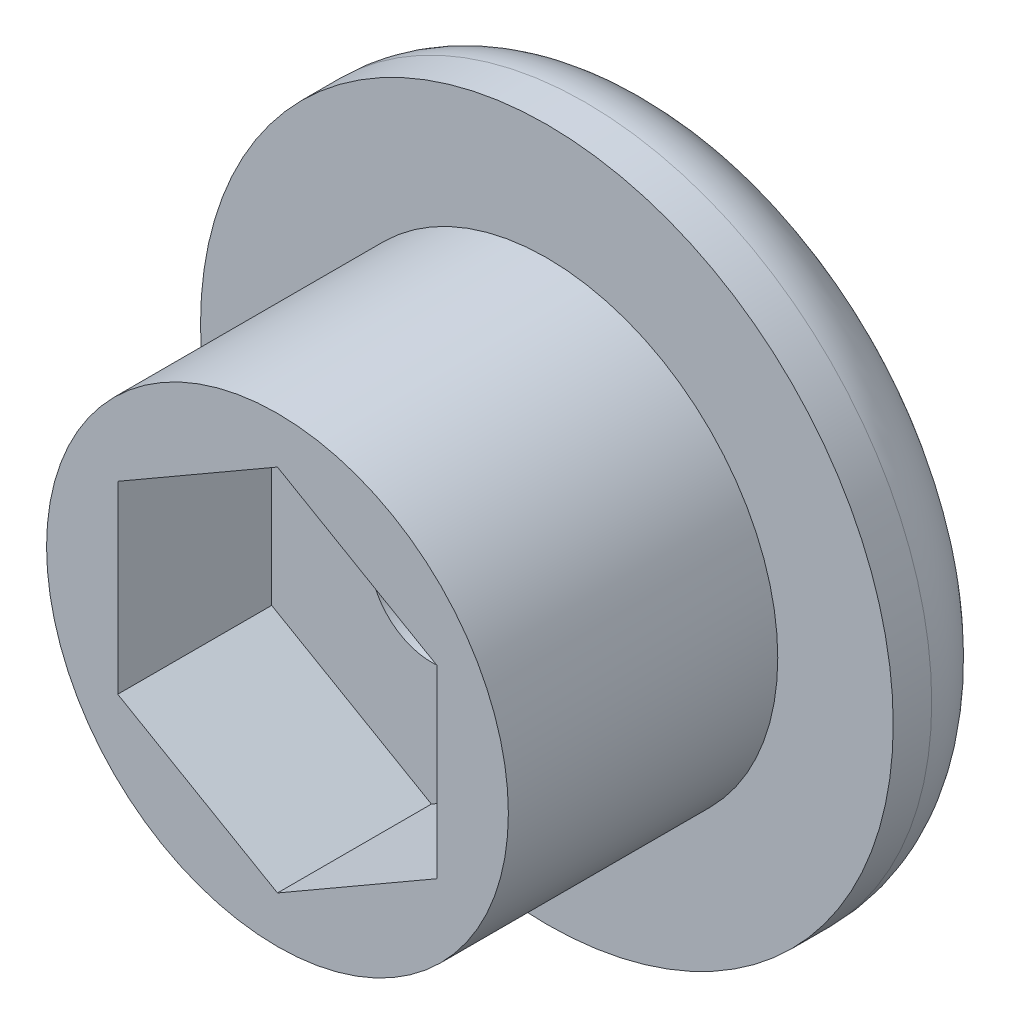
ISO-10303-21;
HEADER;
FILE_DESCRIPTION(('STEP AP214'),'2;1');
FILE_NAME('part.step','',(''),(''),'','','');
FILE_SCHEMA(('AUTOMOTIVE_DESIGN { 1 0 10303 214 1 1 1 1 }'));
ENDSEC;
DATA;
#1=APPLICATION_CONTEXT('core data for automotive mechanical design processes');
#2=APPLICATION_PROTOCOL_DEFINITION('international standard','automotive_design',2000,#1);
#3=PRODUCT_CONTEXT('',#1,'mechanical');
#4=PRODUCT('Part','Part','',(#3));
#5=PRODUCT_RELATED_PRODUCT_CATEGORY('part','',(#4));
#6=PRODUCT_DEFINITION_FORMATION('','',#4);
#7=PRODUCT_DEFINITION_CONTEXT('part definition',#1,'design');
#8=PRODUCT_DEFINITION('design','',#6,#7);
#9=PRODUCT_DEFINITION_SHAPE('','',#8);
#10=(LENGTH_UNIT() NAMED_UNIT(*) SI_UNIT(.MILLI.,.METRE.));
#11=(NAMED_UNIT(*) PLANE_ANGLE_UNIT() SI_UNIT($,.RADIAN.));
#12=(NAMED_UNIT(*) SI_UNIT($,.STERADIAN.) SOLID_ANGLE_UNIT());
#13=UNCERTAINTY_MEASURE_WITH_UNIT(LENGTH_MEASURE(1.E-05),#10,'distance_accuracy_value','');
#14=(GEOMETRIC_REPRESENTATION_CONTEXT(3) GLOBAL_UNCERTAINTY_ASSIGNED_CONTEXT((#13)) GLOBAL_UNIT_ASSIGNED_CONTEXT((#10,
#11,#12)) REPRESENTATION_CONTEXT('',''));
#15=CARTESIAN_POINT('',(0.,0.,0.));
#16=DIRECTION('',(0.,0.,1.));
#17=DIRECTION('',(1.,0.,0.));
#18=AXIS2_PLACEMENT_3D('',#15,#16,#17);
#19=CARTESIAN_POINT('',(-13.5093210312387,-3.65723132460791,43.05));
#20=DIRECTION('',(0.,0.,-1.));
#21=DIRECTION('',(0.,1.,0.));
#22=AXIS2_PLACEMENT_3D('',#19,#20,#21);
#23=CYLINDRICAL_SURFACE('',#22,1.6);
#24=CARTESIAN_POINT('',(-13.5093210312387,-3.65723132460791,37.55));
#25=DIRECTION('',(0.,0.,-1.));
#26=DIRECTION('',(-1.,0.,0.));
#27=AXIS2_PLACEMENT_3D('',#24,#25,#26);
#28=CIRCLE('',#27,1.6);
#29=CARTESIAN_POINT('',(-15.1093210312387,-3.65723132460791,37.55));
#30=VERTEX_POINT('',#29);
#31=EDGE_CURVE('E124',#30,#30,#28,.T.);
#32=ORIENTED_EDGE('',*,*,#31,.F.);
#33=EDGE_LOOP('',(#32));
#34=FACE_BOUND('',#33,.T.);
#35=CARTESIAN_POINT('',(-13.5093210312387,-3.65723132460791,34.55));
#36=DIRECTION('',(0.,0.,-1.));
#37=DIRECTION('',(0.,1.,0.));
#38=AXIS2_PLACEMENT_3D('',#35,#36,#37);
#39=CIRCLE('',#38,1.6);
#40=CARTESIAN_POINT('',(-13.5093210312387,-2.05723132460791,34.55));
#41=VERTEX_POINT('',#40);
#42=EDGE_CURVE('E122',#41,#41,#39,.F.);
#43=ORIENTED_EDGE('',*,*,#42,.F.);
#44=EDGE_LOOP('',(#43));
#45=FACE_BOUND('',#44,.T.);
#46=ADVANCED_FACE('F32',(#34,#45),#23,.F.);
#47=CARTESIAN_POINT('',(-13.5093210312387,-3.65723132460791,41.55));
#48=DIRECTION('',(0.,0.,-1.));
#49=DIRECTION('',(-1.,0.,0.));
#50=AXIS2_PLACEMENT_3D('',#47,#48,#49);
#51=PLANE('',#50);
#52=CARTESIAN_POINT('',(-13.5093210312387,-3.65723132460791,41.55));
#53=DIRECTION('',(0.,0.,-1.));
#54=DIRECTION('',(-1.,0.,0.));
#55=AXIS2_PLACEMENT_3D('',#52,#53,#54);
#56=CIRCLE('',#55,6.);
#57=CARTESIAN_POINT('',(-19.5093210312387,-3.65723132460791,41.55));
#58=VERTEX_POINT('',#57);
#59=EDGE_CURVE('E119',#58,#58,#56,.T.);
#60=ORIENTED_EDGE('',*,*,#59,.F.);
#61=EDGE_LOOP('',(#60));
#62=FACE_BOUND('',#61,.T.);
#63=DIRECTION('',(0.866025403784439,-0.499999999999999,0.));
#64=VECTOR('',#63,1.);
#65=CARTESIAN_POINT('',(-11.4343210312387,-0.0632258989024816,41.55));
#66=LINE('',#65,#64);
#67=CARTESIAN_POINT('',(-13.5093210312387,1.13477590966599,41.55));
#68=VERTEX_POINT('',#67);
#69=CARTESIAN_POINT('',(-9.35932103123867,-1.26122770747095,41.55));
#70=VERTEX_POINT('',#69);
#71=EDGE_CURVE('E47',#68,#70,#66,.T.);
#72=ORIENTED_EDGE('',*,*,#71,.T.);
#73=DIRECTION('',(0.,-1.,0.));
#74=VECTOR('',#73,1.);
#75=CARTESIAN_POINT('',(-9.35932103123868,-3.65723132460791,41.55));
#76=LINE('',#75,#74);
#77=CARTESIAN_POINT('',(-9.35932103123868,-6.05323494174485,41.55));
#78=VERTEX_POINT('',#77);
#79=EDGE_CURVE('E104',#70,#78,#76,.T.);
#80=ORIENTED_EDGE('',*,*,#79,.T.);
#81=DIRECTION('',(-0.866025403784439,-0.5,0.));
#82=VECTOR('',#81,1.);
#83=CARTESIAN_POINT('',(-11.4343210312387,-7.25123675031332,41.55));
#84=LINE('',#83,#82);
#85=CARTESIAN_POINT('',(-13.5093210312387,-8.4492385588818,41.55));
#86=VERTEX_POINT('',#85);
#87=EDGE_CURVE('E102',#78,#86,#84,.T.);
#88=ORIENTED_EDGE('',*,*,#87,.T.);
#89=DIRECTION('',(-0.866025403784439,0.5,0.));
#90=VECTOR('',#89,1.);
#91=CARTESIAN_POINT('',(-15.5843210312387,-7.25123675031333,41.55));
#92=LINE('',#91,#90);
#93=CARTESIAN_POINT('',(-17.6593210312387,-6.05323494174485,41.55));
#94=VERTEX_POINT('',#93);
#95=EDGE_CURVE('E82',#86,#94,#92,.T.);
#96=ORIENTED_EDGE('',*,*,#95,.T.);
#97=DIRECTION('',(0.,1.,0.));
#98=VECTOR('',#97,1.);
#99=CARTESIAN_POINT('',(-17.6593210312387,-3.65723132460791,41.55));
#100=LINE('',#99,#98);
#101=CARTESIAN_POINT('',(-17.6593210312387,-1.26122770747096,41.55));
#102=VERTEX_POINT('',#101);
#103=EDGE_CURVE('E91',#94,#102,#100,.T.);
#104=ORIENTED_EDGE('',*,*,#103,.T.);
#105=DIRECTION('',(0.866025403784439,0.5,0.));
#106=VECTOR('',#105,1.);
#107=CARTESIAN_POINT('',(-15.5843210312387,-0.0632258989024838,41.55));
#108=LINE('',#107,#106);
#109=EDGE_CURVE('E97',#102,#68,#108,.T.);
#110=ORIENTED_EDGE('',*,*,#109,.T.);
#111=EDGE_LOOP('',(#72,#80,#88,#96,#104,#110));
#112=FACE_BOUND('',#111,.T.);
#113=ADVANCED_FACE('F99',(#62,#112),#51,.F.);
#114=CARTESIAN_POINT('',(-13.5093210312387,-3.6572313246079,37.55));
#115=DIRECTION('',(0.,0.,1.));
#116=DIRECTION('',(0.,-1.,0.));
#117=AXIS2_PLACEMENT_3D('',#114,#115,#116);
#118=CYLINDRICAL_SURFACE('',#117,6.);
#119=ORIENTED_EDGE('',*,*,#59,.T.);
#120=EDGE_LOOP('',(#119));
#121=FACE_BOUND('',#120,.T.);
#122=CARTESIAN_POINT('',(-13.5093210312387,-3.6572313246079,34.55));
#123=DIRECTION('',(0.,0.,-1.));
#124=DIRECTION('',(0.,1.,0.));
#125=AXIS2_PLACEMENT_3D('',#122,#123,#124);
#126=CIRCLE('',#125,6.);
#127=CARTESIAN_POINT('',(-13.5093210312387,2.3427686753921,34.55));
#128=VERTEX_POINT('',#127);
#129=EDGE_CURVE('E195',#128,#128,#126,.T.);
#130=ORIENTED_EDGE('',*,*,#129,.F.);
#131=EDGE_LOOP('',(#130));
#132=FACE_BOUND('',#131,.T.);
#133=ADVANCED_FACE('F148',(#121,#132),#118,.T.);
#134=CARTESIAN_POINT('',(-11.4343210312387,-0.0632258989024814,37.55));
#135=DIRECTION('',(-0.499999999999999,-0.866025403784439,0.));
#136=DIRECTION('',(0.866025403784439,-0.499999999999999,0.));
#137=AXIS2_PLACEMENT_3D('',#134,#135,#136);
#138=PLANE('',#137);
#139=ORIENTED_EDGE('',*,*,#71,.F.);
#140=DIRECTION('',(0.,0.,1.));
#141=VECTOR('',#140,1.);
#142=CARTESIAN_POINT('',(-13.5093210312387,1.13477590966599,37.55));
#143=LINE('',#142,#141);
#144=CARTESIAN_POINT('',(-13.5093210312387,1.13477590966599,37.55));
#145=VERTEX_POINT('',#144);
#146=EDGE_CURVE('E110',#145,#68,#143,.T.);
#147=ORIENTED_EDGE('',*,*,#146,.F.);
#148=DIRECTION('',(0.866025403784439,-0.499999999999999,0.));
#149=VECTOR('',#148,1.);
#150=CARTESIAN_POINT('',(-11.4343210312387,-0.0632258989024814,37.55));
#151=LINE('',#150,#149);
#152=CARTESIAN_POINT('',(-9.35932103123867,-1.26122770747095,37.55));
#153=VERTEX_POINT('',#152);
#154=EDGE_CURVE('E109',#145,#153,#151,.T.);
#155=ORIENTED_EDGE('',*,*,#154,.T.);
#156=DIRECTION('',(0.,0.,1.));
#157=VECTOR('',#156,1.);
#158=CARTESIAN_POINT('',(-9.35932103123867,-1.26122770747095,37.55));
#159=LINE('',#158,#157);
#160=EDGE_CURVE('E117',#153,#70,#159,.T.);
#161=ORIENTED_EDGE('',*,*,#160,.T.);
#162=EDGE_LOOP('',(#139,#147,#155,#161));
#163=FACE_BOUND('',#162,.T.);
#164=ADVANCED_FACE('F184',(#163),#138,.T.);
#165=CARTESIAN_POINT('',(-9.35932103123868,-3.65723132460791,37.55));
#166=DIRECTION('',(-1.,0.,0.));
#167=DIRECTION('',(0.,-1.,0.));
#168=AXIS2_PLACEMENT_3D('',#165,#166,#167);
#169=PLANE('',#168);
#170=ORIENTED_EDGE('',*,*,#79,.F.);
#171=ORIENTED_EDGE('',*,*,#160,.F.);
#172=DIRECTION('',(0.,-1.,0.));
#173=VECTOR('',#172,1.);
#174=CARTESIAN_POINT('',(-9.35932103123868,-3.65723132460791,37.55));
#175=LINE('',#174,#173);
#176=CARTESIAN_POINT('',(-9.35932103123868,-6.05323494174485,37.55));
#177=VERTEX_POINT('',#176);
#178=EDGE_CURVE('E205',#153,#177,#175,.T.);
#179=ORIENTED_EDGE('',*,*,#178,.T.);
#180=DIRECTION('',(0.,0.,1.));
#181=VECTOR('',#180,1.);
#182=CARTESIAN_POINT('',(-9.35932103123868,-6.05323494174485,37.55));
#183=LINE('',#182,#181);
#184=EDGE_CURVE('E115',#177,#78,#183,.T.);
#185=ORIENTED_EDGE('',*,*,#184,.T.);
#186=EDGE_LOOP('',(#170,#171,#179,#185));
#187=FACE_BOUND('',#186,.T.);
#188=ADVANCED_FACE('F180',(#187),#169,.T.);
#189=CARTESIAN_POINT('',(-11.4343210312387,-7.25123675031332,37.55));
#190=DIRECTION('',(-0.5,0.866025403784439,0.));
#191=DIRECTION('',(-0.866025403784439,-0.5,0.));
#192=AXIS2_PLACEMENT_3D('',#189,#190,#191);
#193=PLANE('',#192);
#194=ORIENTED_EDGE('',*,*,#87,.F.);
#195=ORIENTED_EDGE('',*,*,#184,.F.);
#196=DIRECTION('',(-0.866025403784439,-0.5,0.));
#197=VECTOR('',#196,1.);
#198=CARTESIAN_POINT('',(-11.4343210312387,-7.25123675031332,37.55));
#199=LINE('',#198,#197);
#200=CARTESIAN_POINT('',(-13.5093210312387,-8.4492385588818,37.55));
#201=VERTEX_POINT('',#200);
#202=EDGE_CURVE('E208',#177,#201,#199,.T.);
#203=ORIENTED_EDGE('',*,*,#202,.T.);
#204=DIRECTION('',(0.,0.,1.));
#205=VECTOR('',#204,1.);
#206=CARTESIAN_POINT('',(-13.5093210312387,-8.4492385588818,37.55));
#207=LINE('',#206,#205);
#208=EDGE_CURVE('E87',#201,#86,#207,.T.);
#209=ORIENTED_EDGE('',*,*,#208,.T.);
#210=EDGE_LOOP('',(#194,#195,#203,#209));
#211=FACE_BOUND('',#210,.T.);
#212=ADVANCED_FACE('F177',(#211),#193,.T.);
#213=CARTESIAN_POINT('',(-15.5843210312387,-7.25123675031333,37.55));
#214=DIRECTION('',(0.5,0.866025403784438,0.));
#215=DIRECTION('',(-0.866025403784439,0.5,0.));
#216=AXIS2_PLACEMENT_3D('',#213,#214,#215);
#217=PLANE('',#216);
#218=ORIENTED_EDGE('',*,*,#95,.F.);
#219=ORIENTED_EDGE('',*,*,#208,.F.);
#220=DIRECTION('',(-0.866025403784439,0.5,0.));
#221=VECTOR('',#220,1.);
#222=CARTESIAN_POINT('',(-15.5843210312387,-7.25123675031333,37.55));
#223=LINE('',#222,#221);
#224=CARTESIAN_POINT('',(-17.6593210312387,-6.05323494174485,37.55));
#225=VERTEX_POINT('',#224);
#226=EDGE_CURVE('E56',#201,#225,#223,.T.);
#227=ORIENTED_EDGE('',*,*,#226,.T.);
#228=DIRECTION('',(0.,0.,1.));
#229=VECTOR('',#228,1.);
#230=CARTESIAN_POINT('',(-17.6593210312387,-6.05323494174485,37.55));
#231=LINE('',#230,#229);
#232=EDGE_CURVE('E77',#225,#94,#231,.T.);
#233=ORIENTED_EDGE('',*,*,#232,.T.);
#234=EDGE_LOOP('',(#218,#219,#227,#233));
#235=FACE_BOUND('',#234,.T.);
#236=ADVANCED_FACE('F79',(#235),#217,.T.);
#237=CARTESIAN_POINT('',(-17.6593210312387,-3.6572313246079,37.55));
#238=DIRECTION('',(1.,0.,0.));
#239=DIRECTION('',(0.,0.,-1.));
#240=AXIS2_PLACEMENT_3D('',#237,#238,#239);
#241=PLANE('',#240);
#242=ORIENTED_EDGE('',*,*,#103,.F.);
#243=ORIENTED_EDGE('',*,*,#232,.F.);
#244=DIRECTION('',(0.,1.,0.));
#245=VECTOR('',#244,1.);
#246=CARTESIAN_POINT('',(-17.6593210312387,-3.6572313246079,37.55));
#247=LINE('',#246,#245);
#248=CARTESIAN_POINT('',(-17.6593210312387,-1.26122770747096,37.55));
#249=VERTEX_POINT('',#248);
#250=EDGE_CURVE('E211',#225,#249,#247,.T.);
#251=ORIENTED_EDGE('',*,*,#250,.T.);
#252=DIRECTION('',(0.,0.,1.));
#253=VECTOR('',#252,1.);
#254=CARTESIAN_POINT('',(-17.6593210312387,-1.26122770747096,37.55));
#255=LINE('',#254,#253);
#256=EDGE_CURVE('E88',#249,#102,#255,.T.);
#257=ORIENTED_EDGE('',*,*,#256,.T.);
#258=EDGE_LOOP('',(#242,#243,#251,#257));
#259=FACE_BOUND('',#258,.T.);
#260=ADVANCED_FACE('F92',(#259),#241,.T.);
#261=CARTESIAN_POINT('',(-15.5843210312387,-0.0632258989024835,37.55));
#262=DIRECTION('',(0.5,-0.866025403784439,0.));
#263=DIRECTION('',(0.866025403784439,0.5,0.));
#264=AXIS2_PLACEMENT_3D('',#261,#262,#263);
#265=PLANE('',#264);
#266=ORIENTED_EDGE('',*,*,#109,.F.);
#267=ORIENTED_EDGE('',*,*,#256,.F.);
#268=DIRECTION('',(0.866025403784439,0.5,0.));
#269=VECTOR('',#268,1.);
#270=CARTESIAN_POINT('',(-15.5843210312387,-0.0632258989024835,37.55));
#271=LINE('',#270,#269);
#272=EDGE_CURVE('E112',#249,#145,#271,.T.);
#273=ORIENTED_EDGE('',*,*,#272,.T.);
#274=ORIENTED_EDGE('',*,*,#146,.T.);
#275=EDGE_LOOP('',(#266,#267,#273,#274));
#276=FACE_BOUND('',#275,.T.);
#277=ADVANCED_FACE('F168',(#276),#265,.T.);
#278=CARTESIAN_POINT('',(-13.5093210312387,-3.6572313246079,37.55));
#279=DIRECTION('',(0.,0.,-1.));
#280=DIRECTION('',(-1.,0.,0.));
#281=AXIS2_PLACEMENT_3D('',#278,#279,#280);
#282=PLANE('',#281);
#283=ORIENTED_EDGE('',*,*,#31,.T.);
#284=EDGE_LOOP('',(#283));
#285=FACE_BOUND('',#284,.T.);
#286=ORIENTED_EDGE('',*,*,#178,.F.);
#287=ORIENTED_EDGE('',*,*,#154,.F.);
#288=ORIENTED_EDGE('',*,*,#272,.F.);
#289=ORIENTED_EDGE('',*,*,#250,.F.);
#290=ORIENTED_EDGE('',*,*,#226,.F.);
#291=ORIENTED_EDGE('',*,*,#202,.F.);
#292=EDGE_LOOP('',(#286,#287,#288,#289,#290,#291));
#293=FACE_BOUND('',#292,.T.);
#294=ADVANCED_FACE('F164',(#285,#293),#282,.F.);
#295=CARTESIAN_POINT('',(-13.5093210312387,-3.6572313246079,31.55));
#296=DIRECTION('',(0.,0.,1.));
#297=DIRECTION('',(0.,-1.,0.));
#298=AXIS2_PLACEMENT_3D('',#295,#296,#297);
#299=CYLINDRICAL_SURFACE('',#298,9.);
#300=CARTESIAN_POINT('',(-13.5093210312387,-3.6572313246079,33.55));
#301=DIRECTION('',(0.,0.,-1.));
#302=DIRECTION('',(0.,1.,0.));
#303=AXIS2_PLACEMENT_3D('',#300,#301,#302);
#304=CIRCLE('',#303,9.);
#305=CARTESIAN_POINT('',(-13.5093210312387,5.34276867539209,33.55));
#306=VERTEX_POINT('',#305);
#307=EDGE_CURVE('E11',#306,#306,#304,.F.);
#308=ORIENTED_EDGE('',*,*,#307,.T.);
#309=EDGE_LOOP('',(#308));
#310=FACE_BOUND('',#309,.T.);
#311=CARTESIAN_POINT('',(-13.5093210312387,-3.6572313246079,34.55));
#312=DIRECTION('',(0.,0.,-1.));
#313=DIRECTION('',(0.,1.,0.));
#314=AXIS2_PLACEMENT_3D('',#311,#312,#313);
#315=CIRCLE('',#314,9.);
#316=CARTESIAN_POINT('',(-13.5093210312387,5.34276867539209,34.55));
#317=VERTEX_POINT('',#316);
#318=EDGE_CURVE('E196',#317,#317,#315,.T.);
#319=ORIENTED_EDGE('',*,*,#318,.T.);
#320=EDGE_LOOP('',(#319));
#321=FACE_BOUND('',#320,.T.);
#322=ADVANCED_FACE('F158',(#310,#321),#299,.T.);
#323=CARTESIAN_POINT('',(-13.5093210312387,-3.6572313246079,31.55));
#324=DIRECTION('',(0.,0.,-1.));
#325=DIRECTION('',(0.,1.,0.));
#326=AXIS2_PLACEMENT_3D('',#323,#324,#325);
#327=PLANE('',#326);
#328=CARTESIAN_POINT('',(-13.5093210312387,-3.6572313246079,31.55));
#329=DIRECTION('',(0.,0.,-1.));
#330=DIRECTION('',(0.,1.,0.));
#331=AXIS2_PLACEMENT_3D('',#328,#329,#330);
#332=CIRCLE('',#331,7.);
#333=CARTESIAN_POINT('',(-13.5093210312387,3.34276867539209,31.55));
#334=VERTEX_POINT('',#333);
#335=EDGE_CURVE('E40',#334,#334,#332,.T.);
#336=ORIENTED_EDGE('',*,*,#335,.T.);
#337=EDGE_LOOP('',(#336));
#338=FACE_BOUND('',#337,.T.);
#339=CARTESIAN_POINT('',(-13.5093210312387,-3.6572313246079,31.55));
#340=DIRECTION('',(0.,0.,-1.));
#341=DIRECTION('',(0.,1.,0.));
#342=AXIS2_PLACEMENT_3D('',#339,#340,#341);
#343=CIRCLE('',#342,3.);
#344=CARTESIAN_POINT('',(-13.5093210312387,-0.657231324607902,31.55));
#345=VERTEX_POINT('',#344);
#346=EDGE_CURVE('E227',#345,#345,#343,.T.);
#347=ORIENTED_EDGE('',*,*,#346,.F.);
#348=EDGE_LOOP('',(#347));
#349=FACE_BOUND('',#348,.T.);
#350=ADVANCED_FACE('F129',(#338,#349),#327,.T.);
#351=CARTESIAN_POINT('',(-13.5093210312387,-3.6572313246079,34.55));
#352=DIRECTION('',(0.,0.,-1.));
#353=DIRECTION('',(0.,1.,0.));
#354=AXIS2_PLACEMENT_3D('',#351,#352,#353);
#355=PLANE('',#354);
#356=ORIENTED_EDGE('',*,*,#129,.T.);
#357=EDGE_LOOP('',(#356));
#358=FACE_BOUND('',#357,.T.);
#359=ORIENTED_EDGE('',*,*,#318,.F.);
#360=EDGE_LOOP('',(#359));
#361=FACE_BOUND('',#360,.T.);
#362=ADVANCED_FACE('F157',(#358,#361),#355,.F.);
#363=CARTESIAN_POINT('',(-13.5093210312387,-3.6572313246079,34.55));
#364=DIRECTION('',(0.,0.,-1.));
#365=DIRECTION('',(0.,1.,0.));
#366=AXIS2_PLACEMENT_3D('',#363,#364,#365);
#367=PLANE('',#366);
#368=CARTESIAN_POINT('',(-13.5093210312387,-3.6572313246079,34.55));
#369=DIRECTION('',(0.,0.,-1.));
#370=DIRECTION('',(0.,1.,0.));
#371=AXIS2_PLACEMENT_3D('',#368,#369,#370);
#372=CIRCLE('',#371,3.);
#373=CARTESIAN_POINT('',(-13.5093210312387,-0.657231324607902,34.55));
#374=VERTEX_POINT('',#373);
#375=EDGE_CURVE('E125',#374,#374,#372,.T.);
#376=ORIENTED_EDGE('',*,*,#375,.T.);
#377=EDGE_LOOP('',(#376));
#378=FACE_BOUND('',#377,.T.);
#379=ORIENTED_EDGE('',*,*,#42,.T.);
#380=EDGE_LOOP('',(#379));
#381=FACE_BOUND('',#380,.T.);
#382=ADVANCED_FACE('F138',(#378,#381),#367,.T.);
#383=CARTESIAN_POINT('',(-13.5093210312387,-3.6572313246079,34.55));
#384=DIRECTION('',(0.,0.,-1.));
#385=DIRECTION('',(0.,1.,0.));
#386=AXIS2_PLACEMENT_3D('',#383,#384,#385);
#387=CYLINDRICAL_SURFACE('',#386,3.);
#388=ORIENTED_EDGE('',*,*,#375,.F.);
#389=EDGE_LOOP('',(#388));
#390=FACE_BOUND('',#389,.T.);
#391=ORIENTED_EDGE('',*,*,#346,.T.);
#392=EDGE_LOOP('',(#391));
#393=FACE_BOUND('',#392,.T.);
#394=ADVANCED_FACE('F133',(#390,#393),#387,.F.);
#395=CARTESIAN_POINT('',(-13.5093210312387,-3.6572313246079,33.55));
#396=DIRECTION('',(0.,0.,-1.));
#397=DIRECTION('',(0.,1.,0.));
#398=AXIS2_PLACEMENT_3D('',#395,#396,#397);
#399=TOROIDAL_SURFACE('',#398,7.,2.);
#400=ORIENTED_EDGE('',*,*,#307,.F.);
#401=EDGE_LOOP('',(#400));
#402=FACE_BOUND('',#401,.T.);
#403=ORIENTED_EDGE('',*,*,#335,.F.);
#404=EDGE_LOOP('',(#403));
#405=FACE_BOUND('',#404,.T.);
#406=ADVANCED_FACE('F34',(#402,#405),#399,.T.);
#407=CLOSED_SHELL('',(#46,#113,#133,#164,#188,#212,#236,#260,#277,#294,#322,#350,#362,#382,#394,#406));
#408=MANIFOLD_SOLID_BREP('B2',#407);
#409=ADVANCED_BREP_SHAPE_REPRESENTATION('',(#18,#408),#14);
#410=SHAPE_DEFINITION_REPRESENTATION(#9,#409);
ENDSEC;
END-ISO-10303-21;
